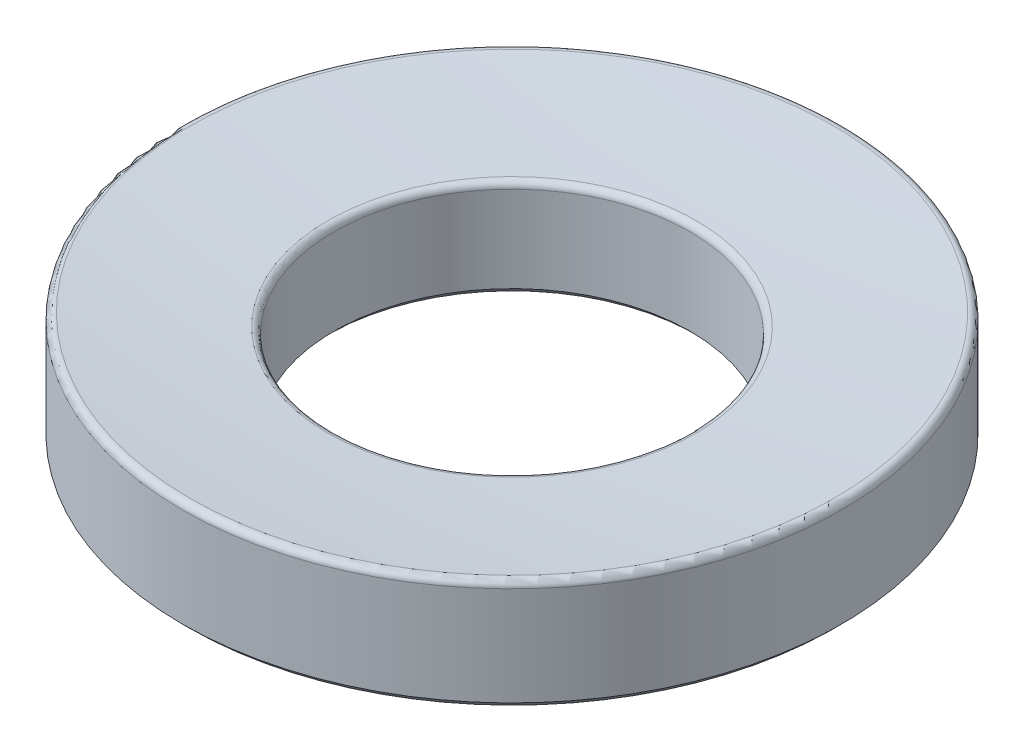
ISO-10303-21;
HEADER;
FILE_DESCRIPTION(('STEP AP214'),'2;1');
FILE_NAME('part.step','',(''),(''),'','','');
FILE_SCHEMA(('AUTOMOTIVE_DESIGN { 1 0 10303 214 1 1 1 1 }'));
ENDSEC;
DATA;
#1=APPLICATION_CONTEXT('core data for automotive mechanical design processes');
#2=APPLICATION_PROTOCOL_DEFINITION('international standard','automotive_design',2000,#1);
#3=PRODUCT_CONTEXT('',#1,'mechanical');
#4=PRODUCT('Part','Part','',(#3));
#5=PRODUCT_RELATED_PRODUCT_CATEGORY('part','',(#4));
#6=PRODUCT_DEFINITION_FORMATION('','',#4);
#7=PRODUCT_DEFINITION_CONTEXT('part definition',#1,'design');
#8=PRODUCT_DEFINITION('design','',#6,#7);
#9=PRODUCT_DEFINITION_SHAPE('','',#8);
#10=(LENGTH_UNIT() NAMED_UNIT(*) SI_UNIT(.MILLI.,.METRE.));
#11=(NAMED_UNIT(*) PLANE_ANGLE_UNIT() SI_UNIT($,.RADIAN.));
#12=(NAMED_UNIT(*) SI_UNIT($,.STERADIAN.) SOLID_ANGLE_UNIT());
#13=UNCERTAINTY_MEASURE_WITH_UNIT(LENGTH_MEASURE(1.E-05),#10,'distance_accuracy_value','');
#14=(GEOMETRIC_REPRESENTATION_CONTEXT(3) GLOBAL_UNCERTAINTY_ASSIGNED_CONTEXT((#13)) GLOBAL_UNIT_ASSIGNED_CONTEXT((#10,
#11,#12)) REPRESENTATION_CONTEXT('',''));
#15=CARTESIAN_POINT('',(0.,0.,0.));
#16=DIRECTION('',(0.,0.,1.));
#17=DIRECTION('',(1.,0.,0.));
#18=AXIS2_PLACEMENT_3D('',#15,#16,#17);
#19=CARTESIAN_POINT('',(0.,0.,0.));
#20=DIRECTION('',(0.,1.,0.));
#21=DIRECTION('',(0.,0.,1.));
#22=AXIS2_PLACEMENT_3D('',#19,#20,#21);
#23=CYLINDRICAL_SURFACE('',#22,12.7);
#24=CARTESIAN_POINT('',(0.,-110.015336067815,0.));
#25=DIRECTION('',(0.,1.,0.));
#26=DIRECTION('',(0.,0.,1.));
#27=AXIS2_PLACEMENT_3D('',#24,#25,#26);
#28=CIRCLE('',#27,12.7);
#29=CARTESIAN_POINT('',(0.,-110.015336067815,12.7));
#30=VERTEX_POINT('',#29);
#31=EDGE_CURVE('E61',#30,#30,#28,.T.);
#32=ORIENTED_EDGE('',*,*,#31,.T.);
#33=EDGE_LOOP('',(#32));
#34=FACE_BOUND('',#33,.T.);
#35=CARTESIAN_POINT('',(0.,-106.207238171417,0.));
#36=DIRECTION('',(0.,1.,0.));
#37=DIRECTION('',(0.,0.,1.));
#38=AXIS2_PLACEMENT_3D('',#35,#36,#37);
#39=CIRCLE('',#38,12.7);
#40=CARTESIAN_POINT('',(0.,-106.207238171417,12.7));
#41=VERTEX_POINT('',#40);
#42=EDGE_CURVE('E66',#41,#41,#39,.F.);
#43=ORIENTED_EDGE('',*,*,#42,.T.);
#44=EDGE_LOOP('',(#43));
#45=FACE_BOUND('',#44,.T.);
#46=ADVANCED_FACE('F46',(#34,#45),#23,.T.);
#47=CARTESIAN_POINT('',(0.,0.,0.));
#48=DIRECTION('',(0.,1.,0.));
#49=DIRECTION('',(1.,0.,0.));
#50=AXIS2_PLACEMENT_3D('',#47,#48,#49);
#51=SPHERICAL_SURFACE('',#50,106.68);
#52=CARTESIAN_POINT('',(0.,-106.443796710953,0.));
#53=DIRECTION('',(0.,1.,0.));
#54=DIRECTION('',(0.,0.,1.));
#55=AXIS2_PLACEMENT_3D('',#52,#53,#54);
#56=CIRCLE('',#55,7.09510688836106);
#57=CARTESIAN_POINT('',(0.,-106.443796710953,7.09510688836106));
#58=VERTEX_POINT('',#57);
#59=EDGE_CURVE('E69',#58,#58,#56,.F.);
#60=ORIENTED_EDGE('',*,*,#59,.T.);
#61=EDGE_LOOP('',(#60));
#62=FACE_BOUND('',#61,.T.);
#63=CARTESIAN_POINT('',(0.,-105.954964446544,0.));
#64=DIRECTION('',(0.,1.,0.));
#65=DIRECTION('',(0.,0.,1.));
#66=AXIS2_PLACEMENT_3D('',#63,#64,#65);
#67=CIRCLE('',#66,12.4164370546318);
#68=CARTESIAN_POINT('',(0.,-105.954964446544,12.4164370546318));
#69=VERTEX_POINT('',#68);
#70=EDGE_CURVE('E72',#69,#69,#67,.T.);
#71=ORIENTED_EDGE('',*,*,#70,.T.);
#72=EDGE_LOOP('',(#71));
#73=FACE_BOUND('',#72,.T.);
#74=ADVANCED_FACE('F98',(#62,#73),#51,.F.);
#75=CARTESIAN_POINT('',(0.,0.,0.));
#76=DIRECTION('',(0.,1.,0.));
#77=DIRECTION('',(0.,0.,1.));
#78=AXIS2_PLACEMENT_3D('',#75,#76,#77);
#79=CYLINDRICAL_SURFACE('',#78,6.85800000000001);
#80=CARTESIAN_POINT('',(0.,-110.015336067815,0.));
#81=DIRECTION('',(0.,1.,0.));
#82=DIRECTION('',(0.,0.,1.));
#83=AXIS2_PLACEMENT_3D('',#80,#81,#82);
#84=CIRCLE('',#83,6.85800000000001);
#85=CARTESIAN_POINT('',(0.,-110.015336067815,6.85800000000001));
#86=VERTEX_POINT('',#85);
#87=EDGE_CURVE('E12',#86,#86,#84,.F.);
#88=ORIENTED_EDGE('',*,*,#87,.T.);
#89=EDGE_LOOP('',(#88));
#90=FACE_BOUND('',#89,.T.);
#91=CARTESIAN_POINT('',(0.,-106.69723432217,0.));
#92=DIRECTION('',(0.,1.,0.));
#93=DIRECTION('',(0.,0.,1.));
#94=AXIS2_PLACEMENT_3D('',#91,#92,#93);
#95=CIRCLE('',#94,6.85800000000001);
#96=CARTESIAN_POINT('',(0.,-106.69723432217,6.85800000000001));
#97=VERTEX_POINT('',#96);
#98=EDGE_CURVE('E75',#97,#97,#95,.T.);
#99=ORIENTED_EDGE('',*,*,#98,.T.);
#100=EDGE_LOOP('',(#99));
#101=FACE_BOUND('',#100,.T.);
#102=ADVANCED_FACE('F79',(#90,#101),#79,.F.);
#103=CARTESIAN_POINT('',(6.85800000000002,-110.269336067815,0.));
#104=DIRECTION('',(0.,1.,0.));
#105=DIRECTION('',(0.,0.,1.));
#106=AXIS2_PLACEMENT_3D('',#103,#104,#105);
#107=PLANE('',#106);
#108=CARTESIAN_POINT('',(0.,-110.269336067815,0.));
#109=DIRECTION('',(0.,1.,0.));
#110=DIRECTION('',(0.,0.,1.));
#111=AXIS2_PLACEMENT_3D('',#108,#109,#110);
#112=CIRCLE('',#111,12.446);
#113=CARTESIAN_POINT('',(0.,-110.269336067815,12.446));
#114=VERTEX_POINT('',#113);
#115=EDGE_CURVE('E53',#114,#114,#112,.F.);
#116=ORIENTED_EDGE('',*,*,#115,.T.);
#117=EDGE_LOOP('',(#116));
#118=FACE_BOUND('',#117,.T.);
#119=CARTESIAN_POINT('',(0.,-110.269336067815,0.));
#120=DIRECTION('',(0.,1.,0.));
#121=DIRECTION('',(0.,0.,1.));
#122=AXIS2_PLACEMENT_3D('',#119,#120,#121);
#123=CIRCLE('',#122,7.11200000000001);
#124=CARTESIAN_POINT('',(0.,-110.269336067815,7.11200000000001));
#125=VERTEX_POINT('',#124);
#126=EDGE_CURVE('E57',#125,#125,#123,.T.);
#127=ORIENTED_EDGE('',*,*,#126,.T.);
#128=EDGE_LOOP('',(#127));
#129=FACE_BOUND('',#128,.T.);
#130=ADVANCED_FACE('F84',(#118,#129),#107,.F.);
#131=CARTESIAN_POINT('',(0.,-106.69723432217,0.));
#132=DIRECTION('',(0.,1.,0.));
#133=DIRECTION('',(0.,0.,1.));
#134=AXIS2_PLACEMENT_3D('',#131,#132,#133);
#135=TOROIDAL_SURFACE('',#134,7.11200000000001,0.254);
#136=ORIENTED_EDGE('',*,*,#59,.F.);
#137=EDGE_LOOP('',(#136));
#138=FACE_BOUND('',#137,.T.);
#139=ORIENTED_EDGE('',*,*,#98,.F.);
#140=EDGE_LOOP('',(#139));
#141=FACE_BOUND('',#140,.T.);
#142=ADVANCED_FACE('F81',(#138,#141),#135,.T.);
#143=CARTESIAN_POINT('',(0.,-106.207238171417,0.));
#144=DIRECTION('',(0.,1.,0.));
#145=DIRECTION('',(0.,0.,1.));
#146=AXIS2_PLACEMENT_3D('',#143,#144,#145);
#147=TOROIDAL_SURFACE('',#146,12.446,0.254);
#148=ORIENTED_EDGE('',*,*,#42,.F.);
#149=EDGE_LOOP('',(#148));
#150=FACE_BOUND('',#149,.T.);
#151=ORIENTED_EDGE('',*,*,#70,.F.);
#152=EDGE_LOOP('',(#151));
#153=FACE_BOUND('',#152,.T.);
#154=ADVANCED_FACE('F83',(#150,#153),#147,.T.);
#155=CARTESIAN_POINT('',(0.,-110.015336067815,0.));
#156=DIRECTION('',(0.,1.,0.));
#157=DIRECTION('',(0.,0.,1.));
#158=AXIS2_PLACEMENT_3D('',#155,#156,#157);
#159=CONICAL_SURFACE('',#158,12.7,0.785398163397438);
#160=ORIENTED_EDGE('',*,*,#115,.F.);
#161=EDGE_LOOP('',(#160));
#162=FACE_BOUND('',#161,.T.);
#163=ORIENTED_EDGE('',*,*,#31,.F.);
#164=EDGE_LOOP('',(#163));
#165=FACE_BOUND('',#164,.T.);
#166=ADVANCED_FACE('F91',(#162,#165),#159,.T.);
#167=CARTESIAN_POINT('',(0.,-110.269336067815,0.));
#168=DIRECTION('',(0.,-1.,0.));
#169=DIRECTION('',(0.,0.,-1.));
#170=AXIS2_PLACEMENT_3D('',#167,#168,#169);
#171=CONICAL_SURFACE('',#170,7.11200000000001,0.785398163397435);
#172=ORIENTED_EDGE('',*,*,#87,.F.);
#173=EDGE_LOOP('',(#172));
#174=FACE_BOUND('',#173,.T.);
#175=ORIENTED_EDGE('',*,*,#126,.F.);
#176=EDGE_LOOP('',(#175));
#177=FACE_BOUND('',#176,.T.);
#178=ADVANCED_FACE('F48',(#174,#177),#171,.F.);
#179=CLOSED_SHELL('',(#46,#74,#102,#130,#142,#154,#166,#178));
#180=MANIFOLD_SOLID_BREP('B2',#179);
#181=ADVANCED_BREP_SHAPE_REPRESENTATION('',(#18,#180),#14);
#182=SHAPE_DEFINITION_REPRESENTATION(#9,#181);
ENDSEC;
END-ISO-10303-21;
